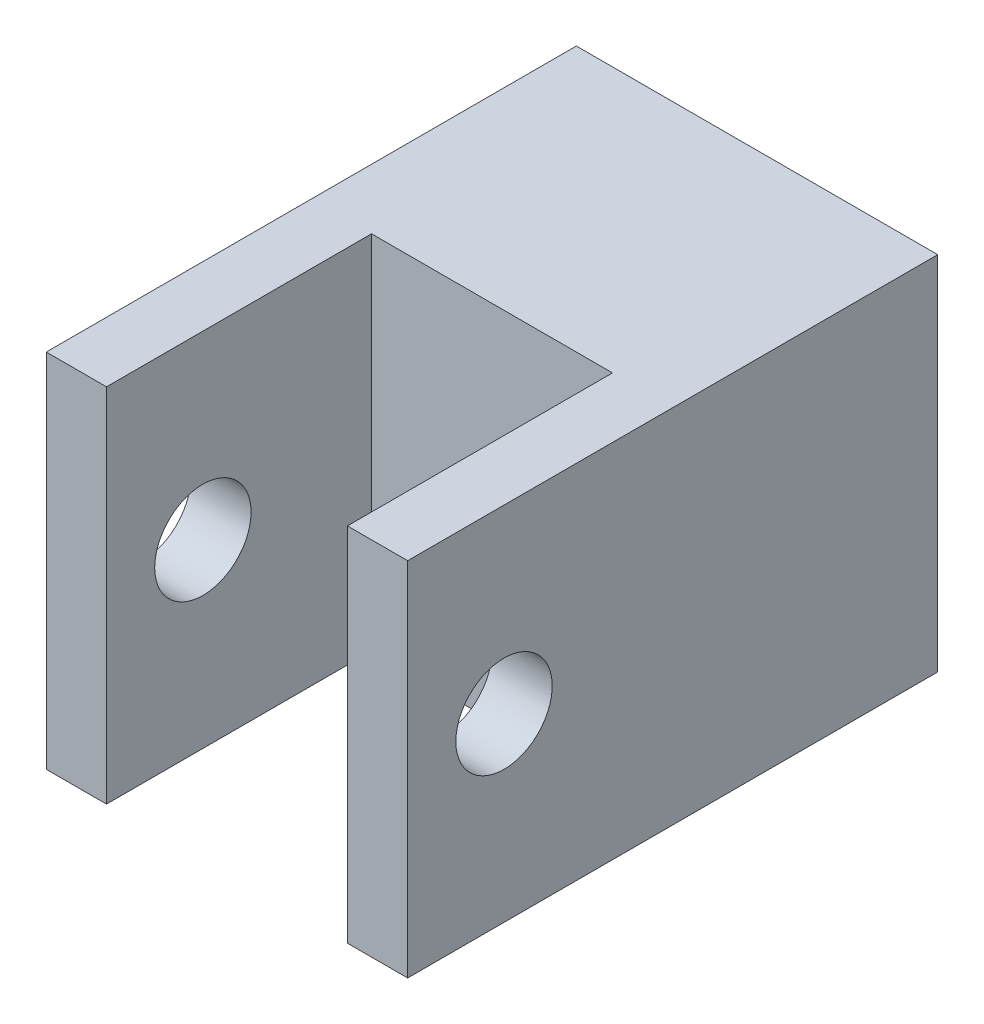
ISO-10303-21;
HEADER;
FILE_DESCRIPTION(('STEP AP214'),'2;1');
FILE_NAME('part.step','',(''),(''),'','','');
FILE_SCHEMA(('AUTOMOTIVE_DESIGN { 1 0 10303 214 1 1 1 1 }'));
ENDSEC;
DATA;
#1=APPLICATION_CONTEXT('core data for automotive mechanical design processes');
#2=APPLICATION_PROTOCOL_DEFINITION('international standard','automotive_design',2000,#1);
#3=PRODUCT_CONTEXT('',#1,'mechanical');
#4=PRODUCT('Part','Part','',(#3));
#5=PRODUCT_RELATED_PRODUCT_CATEGORY('part','',(#4));
#6=PRODUCT_DEFINITION_FORMATION('','',#4);
#7=PRODUCT_DEFINITION_CONTEXT('part definition',#1,'design');
#8=PRODUCT_DEFINITION('design','',#6,#7);
#9=PRODUCT_DEFINITION_SHAPE('','',#8);
#10=(LENGTH_UNIT() NAMED_UNIT(*) SI_UNIT(.MILLI.,.METRE.));
#11=(NAMED_UNIT(*) PLANE_ANGLE_UNIT() SI_UNIT($,.RADIAN.));
#12=(NAMED_UNIT(*) SI_UNIT($,.STERADIAN.) SOLID_ANGLE_UNIT());
#13=UNCERTAINTY_MEASURE_WITH_UNIT(LENGTH_MEASURE(1.E-05),#10,'distance_accuracy_value','');
#14=(GEOMETRIC_REPRESENTATION_CONTEXT(3) GLOBAL_UNCERTAINTY_ASSIGNED_CONTEXT((#13)) GLOBAL_UNIT_ASSIGNED_CONTEXT((#10,
#11,#12)) REPRESENTATION_CONTEXT('',''));
#15=CARTESIAN_POINT('',(0.,0.,0.));
#16=DIRECTION('',(0.,0.,1.));
#17=DIRECTION('',(1.,0.,0.));
#18=AXIS2_PLACEMENT_3D('',#15,#16,#17);
#19=CARTESIAN_POINT('',(0.,0.,22.));
#20=DIRECTION('',(0.,0.,-1.));
#21=DIRECTION('',(-1.,0.,0.));
#22=AXIS2_PLACEMENT_3D('',#19,#20,#21);
#23=PLANE('',#22);
#24=DIRECTION('',(0.,1.,0.));
#25=VECTOR('',#24,1.);
#26=CARTESIAN_POINT('',(-5.,-7.5,22.));
#27=LINE('',#26,#25);
#28=CARTESIAN_POINT('',(-5.,-7.5,22.));
#29=VERTEX_POINT('',#28);
#30=CARTESIAN_POINT('',(-5.,7.5,22.));
#31=VERTEX_POINT('',#30);
#32=EDGE_CURVE('E204',#29,#31,#27,.T.);
#33=ORIENTED_EDGE('',*,*,#32,.T.);
#34=DIRECTION('',(-1.,0.,0.));
#35=VECTOR('',#34,1.);
#36=CARTESIAN_POINT('',(-7.5,7.5,22.));
#37=LINE('',#36,#35);
#38=CARTESIAN_POINT('',(-7.5,7.5,22.));
#39=VERTEX_POINT('',#38);
#40=EDGE_CURVE('E139',#31,#39,#37,.T.);
#41=ORIENTED_EDGE('',*,*,#40,.T.);
#42=DIRECTION('',(0.,-1.,0.));
#43=VECTOR('',#42,1.);
#44=CARTESIAN_POINT('',(-7.5,-7.5,22.));
#45=LINE('',#44,#43);
#46=CARTESIAN_POINT('',(-7.5,-7.5,22.));
#47=VERTEX_POINT('',#46);
#48=EDGE_CURVE('E154',#39,#47,#45,.T.);
#49=ORIENTED_EDGE('',*,*,#48,.T.);
#50=DIRECTION('',(1.,0.,0.));
#51=VECTOR('',#50,1.);
#52=CARTESIAN_POINT('',(-7.5,-7.5,22.));
#53=LINE('',#52,#51);
#54=EDGE_CURVE('E157',#47,#29,#53,.T.);
#55=ORIENTED_EDGE('',*,*,#54,.T.);
#56=EDGE_LOOP('',(#33,#41,#49,#55));
#57=FACE_BOUND('',#56,.T.);
#58=ADVANCED_FACE('F41',(#57),#23,.F.);
#59=CARTESIAN_POINT('',(7.5,-7.5,22.));
#60=DIRECTION('',(-1.,0.,0.));
#61=DIRECTION('',(0.,0.,1.));
#62=AXIS2_PLACEMENT_3D('',#59,#60,#61);
#63=PLANE('',#62);
#64=CARTESIAN_POINT('',(7.5,0.,18.));
#65=DIRECTION('',(-1.,0.,0.));
#66=DIRECTION('',(0.,0.,1.));
#67=AXIS2_PLACEMENT_3D('',#64,#65,#66);
#68=CIRCLE('',#67,2.);
#69=CARTESIAN_POINT('',(7.5,0.,20.));
#70=VERTEX_POINT('',#69);
#71=EDGE_CURVE('E206',#70,#70,#68,.T.);
#72=ORIENTED_EDGE('',*,*,#71,.T.);
#73=EDGE_LOOP('',(#72));
#74=FACE_BOUND('',#73,.T.);
#75=DIRECTION('',(0.,1.,0.));
#76=VECTOR('',#75,1.);
#77=CARTESIAN_POINT('',(7.5,-7.5,0.));
#78=LINE('',#77,#76);
#79=CARTESIAN_POINT('',(7.5,-7.5,0.));
#80=VERTEX_POINT('',#79);
#81=CARTESIAN_POINT('',(7.5,7.5,0.));
#82=VERTEX_POINT('',#81);
#83=EDGE_CURVE('E162',#80,#82,#78,.T.);
#84=ORIENTED_EDGE('',*,*,#83,.T.);
#85=DIRECTION('',(0.,0.,-1.));
#86=VECTOR('',#85,1.);
#87=CARTESIAN_POINT('',(7.5,7.5,22.));
#88=LINE('',#87,#86);
#89=CARTESIAN_POINT('',(7.5,7.5,22.));
#90=VERTEX_POINT('',#89);
#91=EDGE_CURVE('E11',#90,#82,#88,.T.);
#92=ORIENTED_EDGE('',*,*,#91,.F.);
#93=DIRECTION('',(0.,1.,0.));
#94=VECTOR('',#93,1.);
#95=CARTESIAN_POINT('',(7.5,-7.5,22.));
#96=LINE('',#95,#94);
#97=CARTESIAN_POINT('',(7.5,-7.5,22.));
#98=VERTEX_POINT('',#97);
#99=EDGE_CURVE('E149',#98,#90,#96,.T.);
#100=ORIENTED_EDGE('',*,*,#99,.F.);
#101=DIRECTION('',(0.,0.,-1.));
#102=VECTOR('',#101,1.);
#103=CARTESIAN_POINT('',(7.5,-7.5,22.));
#104=LINE('',#103,#102);
#105=EDGE_CURVE('E161',#98,#80,#104,.T.);
#106=ORIENTED_EDGE('',*,*,#105,.T.);
#107=EDGE_LOOP('',(#84,#92,#100,#106));
#108=FACE_BOUND('',#107,.T.);
#109=ADVANCED_FACE('F43',(#74,#108),#63,.F.);
#110=CARTESIAN_POINT('',(-7.5,7.5,22.));
#111=DIRECTION('',(0.,-1.,0.));
#112=DIRECTION('',(0.,0.,-1.));
#113=AXIS2_PLACEMENT_3D('',#110,#111,#112);
#114=PLANE('',#113);
#115=DIRECTION('',(-1.,0.,0.));
#116=VECTOR('',#115,1.);
#117=CARTESIAN_POINT('',(5.,7.5,11.));
#118=LINE('',#117,#116);
#119=CARTESIAN_POINT('',(5.,7.5,11.));
#120=VERTEX_POINT('',#119);
#121=CARTESIAN_POINT('',(-5.,7.5,11.));
#122=VERTEX_POINT('',#121);
#123=EDGE_CURVE('E126',#120,#122,#118,.T.);
#124=ORIENTED_EDGE('',*,*,#123,.F.);
#125=DIRECTION('',(0.,0.,1.));
#126=VECTOR('',#125,1.);
#127=CARTESIAN_POINT('',(5.,7.5,11.));
#128=LINE('',#127,#126);
#129=CARTESIAN_POINT('',(5.,7.5,22.));
#130=VERTEX_POINT('',#129);
#131=EDGE_CURVE('E167',#120,#130,#128,.T.);
#132=ORIENTED_EDGE('',*,*,#131,.T.);
#133=EDGE_CURVE('E96',#90,#130,#37,.T.);
#134=ORIENTED_EDGE('',*,*,#133,.F.);
#135=ORIENTED_EDGE('',*,*,#91,.T.);
#136=DIRECTION('',(-1.,0.,0.));
#137=VECTOR('',#136,1.);
#138=CARTESIAN_POINT('',(-7.5,7.5,0.));
#139=LINE('',#138,#137);
#140=CARTESIAN_POINT('',(-7.5,7.5,0.));
#141=VERTEX_POINT('',#140);
#142=EDGE_CURVE('E166',#82,#141,#139,.T.);
#143=ORIENTED_EDGE('',*,*,#142,.T.);
#144=DIRECTION('',(0.,0.,-1.));
#145=VECTOR('',#144,1.);
#146=CARTESIAN_POINT('',(-7.5,7.5,22.));
#147=LINE('',#146,#145);
#148=EDGE_CURVE('E51',#39,#141,#147,.T.);
#149=ORIENTED_EDGE('',*,*,#148,.F.);
#150=ORIENTED_EDGE('',*,*,#40,.F.);
#151=DIRECTION('',(0.,0.,1.));
#152=VECTOR('',#151,1.);
#153=CARTESIAN_POINT('',(-5.,7.5,11.));
#154=LINE('',#153,#152);
#155=EDGE_CURVE('E58',#122,#31,#154,.T.);
#156=ORIENTED_EDGE('',*,*,#155,.F.);
#157=EDGE_LOOP('',(#124,#132,#134,#135,#143,#149,#150,#156));
#158=FACE_BOUND('',#157,.T.);
#159=ADVANCED_FACE('F137',(#158),#114,.F.);
#160=CARTESIAN_POINT('',(-7.5,-7.5,22.));
#161=DIRECTION('',(1.,0.,0.));
#162=DIRECTION('',(0.,0.,-1.));
#163=AXIS2_PLACEMENT_3D('',#160,#161,#162);
#164=PLANE('',#163);
#165=CARTESIAN_POINT('',(-7.5,0.,18.));
#166=DIRECTION('',(-1.,0.,0.));
#167=DIRECTION('',(0.,0.,1.));
#168=AXIS2_PLACEMENT_3D('',#165,#166,#167);
#169=CIRCLE('',#168,2.);
#170=CARTESIAN_POINT('',(-7.5,0.,20.));
#171=VERTEX_POINT('',#170);
#172=EDGE_CURVE('E217',#171,#171,#169,.T.);
#173=ORIENTED_EDGE('',*,*,#172,.F.);
#174=EDGE_LOOP('',(#173));
#175=FACE_BOUND('',#174,.T.);
#176=DIRECTION('',(0.,-1.,0.));
#177=VECTOR('',#176,1.);
#178=CARTESIAN_POINT('',(-7.5,-7.5,0.));
#179=LINE('',#178,#177);
#180=CARTESIAN_POINT('',(-7.5,-7.5,0.));
#181=VERTEX_POINT('',#180);
#182=EDGE_CURVE('E170',#141,#181,#179,.T.);
#183=ORIENTED_EDGE('',*,*,#182,.T.);
#184=DIRECTION('',(0.,0.,-1.));
#185=VECTOR('',#184,1.);
#186=CARTESIAN_POINT('',(-7.5,-7.5,22.));
#187=LINE('',#186,#185);
#188=EDGE_CURVE('E177',#47,#181,#187,.T.);
#189=ORIENTED_EDGE('',*,*,#188,.F.);
#190=ORIENTED_EDGE('',*,*,#48,.F.);
#191=ORIENTED_EDGE('',*,*,#148,.T.);
#192=EDGE_LOOP('',(#183,#189,#190,#191));
#193=FACE_BOUND('',#192,.T.);
#194=ADVANCED_FACE('F185',(#175,#193),#164,.F.);
#195=CARTESIAN_POINT('',(-7.5,-7.5,22.));
#196=DIRECTION('',(0.,1.,0.));
#197=DIRECTION('',(0.,0.,1.));
#198=AXIS2_PLACEMENT_3D('',#195,#196,#197);
#199=PLANE('',#198);
#200=CARTESIAN_POINT('',(5.,-7.5,22.));
#201=VERTEX_POINT('',#200);
#202=EDGE_CURVE('E67',#201,#98,#53,.T.);
#203=ORIENTED_EDGE('',*,*,#202,.F.);
#204=DIRECTION('',(0.,0.,1.));
#205=VECTOR('',#204,1.);
#206=CARTESIAN_POINT('',(5.,-7.5,11.));
#207=LINE('',#206,#205);
#208=CARTESIAN_POINT('',(5.,-7.5,11.));
#209=VERTEX_POINT('',#208);
#210=EDGE_CURVE('E144',#209,#201,#207,.T.);
#211=ORIENTED_EDGE('',*,*,#210,.F.);
#212=DIRECTION('',(-1.,0.,0.));
#213=VECTOR('',#212,1.);
#214=CARTESIAN_POINT('',(5.,-7.5,11.));
#215=LINE('',#214,#213);
#216=CARTESIAN_POINT('',(-5.,-7.5,11.));
#217=VERTEX_POINT('',#216);
#218=EDGE_CURVE('E125',#209,#217,#215,.T.);
#219=ORIENTED_EDGE('',*,*,#218,.T.);
#220=DIRECTION('',(0.,0.,1.));
#221=VECTOR('',#220,1.);
#222=CARTESIAN_POINT('',(-5.,-7.5,11.));
#223=LINE('',#222,#221);
#224=EDGE_CURVE('E121',#217,#29,#223,.T.);
#225=ORIENTED_EDGE('',*,*,#224,.T.);
#226=ORIENTED_EDGE('',*,*,#54,.F.);
#227=ORIENTED_EDGE('',*,*,#188,.T.);
#228=DIRECTION('',(1.,0.,0.));
#229=VECTOR('',#228,1.);
#230=CARTESIAN_POINT('',(-7.5,-7.5,0.));
#231=LINE('',#230,#229);
#232=EDGE_CURVE('E89',#181,#80,#231,.T.);
#233=ORIENTED_EDGE('',*,*,#232,.T.);
#234=ORIENTED_EDGE('',*,*,#105,.F.);
#235=EDGE_LOOP('',(#203,#211,#219,#225,#226,#227,#233,#234));
#236=FACE_BOUND('',#235,.T.);
#237=ADVANCED_FACE('F193',(#236),#199,.F.);
#238=ORIENTED_EDGE('',*,*,#133,.T.);
#239=DIRECTION('',(0.,1.,0.));
#240=VECTOR('',#239,1.);
#241=CARTESIAN_POINT('',(5.,-7.5,22.));
#242=LINE('',#241,#240);
#243=EDGE_CURVE('E134',#201,#130,#242,.T.);
#244=ORIENTED_EDGE('',*,*,#243,.F.);
#245=ORIENTED_EDGE('',*,*,#202,.T.);
#246=ORIENTED_EDGE('',*,*,#99,.T.);
#247=EDGE_LOOP('',(#238,#244,#245,#246));
#248=FACE_BOUND('',#247,.T.);
#249=ADVANCED_FACE('F241',(#248),#23,.F.);
#250=CARTESIAN_POINT('',(0.,0.,0.));
#251=DIRECTION('',(0.,0.,-1.));
#252=DIRECTION('',(-1.,0.,0.));
#253=AXIS2_PLACEMENT_3D('',#250,#251,#252);
#254=PLANE('',#253);
#255=ORIENTED_EDGE('',*,*,#83,.F.);
#256=ORIENTED_EDGE('',*,*,#232,.F.);
#257=ORIENTED_EDGE('',*,*,#182,.F.);
#258=ORIENTED_EDGE('',*,*,#142,.F.);
#259=EDGE_LOOP('',(#255,#256,#257,#258));
#260=FACE_BOUND('',#259,.T.);
#261=ADVANCED_FACE('F189',(#260),#254,.T.);
#262=CARTESIAN_POINT('',(5.,-7.5,11.));
#263=DIRECTION('',(1.,0.,0.));
#264=DIRECTION('',(0.,0.,-1.));
#265=AXIS2_PLACEMENT_3D('',#262,#263,#264);
#266=PLANE('',#265);
#267=CARTESIAN_POINT('',(5.,0.,18.));
#268=DIRECTION('',(1.,0.,0.));
#269=DIRECTION('',(0.,0.,-1.));
#270=AXIS2_PLACEMENT_3D('',#267,#268,#269);
#271=CIRCLE('',#270,2.);
#272=CARTESIAN_POINT('',(5.,0.,16.));
#273=VERTEX_POINT('',#272);
#274=EDGE_CURVE('E213',#273,#273,#271,.T.);
#275=ORIENTED_EDGE('',*,*,#274,.T.);
#276=EDGE_LOOP('',(#275));
#277=FACE_BOUND('',#276,.T.);
#278=ORIENTED_EDGE('',*,*,#243,.T.);
#279=ORIENTED_EDGE('',*,*,#131,.F.);
#280=DIRECTION('',(0.,1.,0.));
#281=VECTOR('',#280,1.);
#282=CARTESIAN_POINT('',(5.,-7.5,11.));
#283=LINE('',#282,#281);
#284=EDGE_CURVE('E132',#209,#120,#283,.T.);
#285=ORIENTED_EDGE('',*,*,#284,.F.);
#286=ORIENTED_EDGE('',*,*,#210,.T.);
#287=EDGE_LOOP('',(#278,#279,#285,#286));
#288=FACE_BOUND('',#287,.T.);
#289=ADVANCED_FACE('F229',(#277,#288),#266,.F.);
#290=CARTESIAN_POINT('',(-5.,-7.5,11.));
#291=DIRECTION('',(1.,0.,0.));
#292=DIRECTION('',(0.,0.,-1.));
#293=AXIS2_PLACEMENT_3D('',#290,#291,#292);
#294=PLANE('',#293);
#295=CARTESIAN_POINT('',(-5.,0.,18.));
#296=DIRECTION('',(1.,0.,0.));
#297=DIRECTION('',(0.,0.,-1.));
#298=AXIS2_PLACEMENT_3D('',#295,#296,#297);
#299=CIRCLE('',#298,2.);
#300=CARTESIAN_POINT('',(-5.,0.,16.));
#301=VERTEX_POINT('',#300);
#302=EDGE_CURVE('E45',#301,#301,#299,.T.);
#303=ORIENTED_EDGE('',*,*,#302,.F.);
#304=EDGE_LOOP('',(#303));
#305=FACE_BOUND('',#304,.T.);
#306=ORIENTED_EDGE('',*,*,#32,.F.);
#307=ORIENTED_EDGE('',*,*,#224,.F.);
#308=DIRECTION('',(0.,1.,0.));
#309=VECTOR('',#308,1.);
#310=CARTESIAN_POINT('',(-5.,-7.5,11.));
#311=LINE('',#310,#309);
#312=EDGE_CURVE('E117',#217,#122,#311,.T.);
#313=ORIENTED_EDGE('',*,*,#312,.T.);
#314=ORIENTED_EDGE('',*,*,#155,.T.);
#315=EDGE_LOOP('',(#306,#307,#313,#314));
#316=FACE_BOUND('',#315,.T.);
#317=ADVANCED_FACE('F119',(#305,#316),#294,.T.);
#318=CARTESIAN_POINT('',(0.,0.,11.));
#319=DIRECTION('',(0.,0.,-1.));
#320=DIRECTION('',(-1.,0.,0.));
#321=AXIS2_PLACEMENT_3D('',#318,#319,#320);
#322=PLANE('',#321);
#323=ORIENTED_EDGE('',*,*,#123,.T.);
#324=ORIENTED_EDGE('',*,*,#312,.F.);
#325=ORIENTED_EDGE('',*,*,#218,.F.);
#326=ORIENTED_EDGE('',*,*,#284,.T.);
#327=EDGE_LOOP('',(#323,#324,#325,#326));
#328=FACE_BOUND('',#327,.T.);
#329=ADVANCED_FACE('F130',(#328),#322,.F.);
#330=CARTESIAN_POINT('',(17.5,0.,18.));
#331=DIRECTION('',(-1.,0.,0.));
#332=DIRECTION('',(0.,0.,1.));
#333=AXIS2_PLACEMENT_3D('',#330,#331,#332);
#334=CYLINDRICAL_SURFACE('',#333,2.);
#335=ORIENTED_EDGE('',*,*,#302,.T.);
#336=EDGE_LOOP('',(#335));
#337=FACE_BOUND('',#336,.T.);
#338=ORIENTED_EDGE('',*,*,#172,.T.);
#339=EDGE_LOOP('',(#338));
#340=FACE_BOUND('',#339,.T.);
#341=ADVANCED_FACE('F226',(#337,#340),#334,.F.);
#342=ORIENTED_EDGE('',*,*,#274,.F.);
#343=EDGE_LOOP('',(#342));
#344=FACE_BOUND('',#343,.T.);
#345=ORIENTED_EDGE('',*,*,#71,.F.);
#346=EDGE_LOOP('',(#345));
#347=FACE_BOUND('',#346,.T.);
#348=ADVANCED_FACE('F292',(#344,#347),#334,.F.);
#349=CLOSED_SHELL('',(#58,#109,#159,#194,#237,#249,#261,#289,#317,#329,#341,#348));
#350=MANIFOLD_SOLID_BREP('B2',#349);
#351=ADVANCED_BREP_SHAPE_REPRESENTATION('',(#18,#350),#14);
#352=SHAPE_DEFINITION_REPRESENTATION(#9,#351);
ENDSEC;
END-ISO-10303-21;
